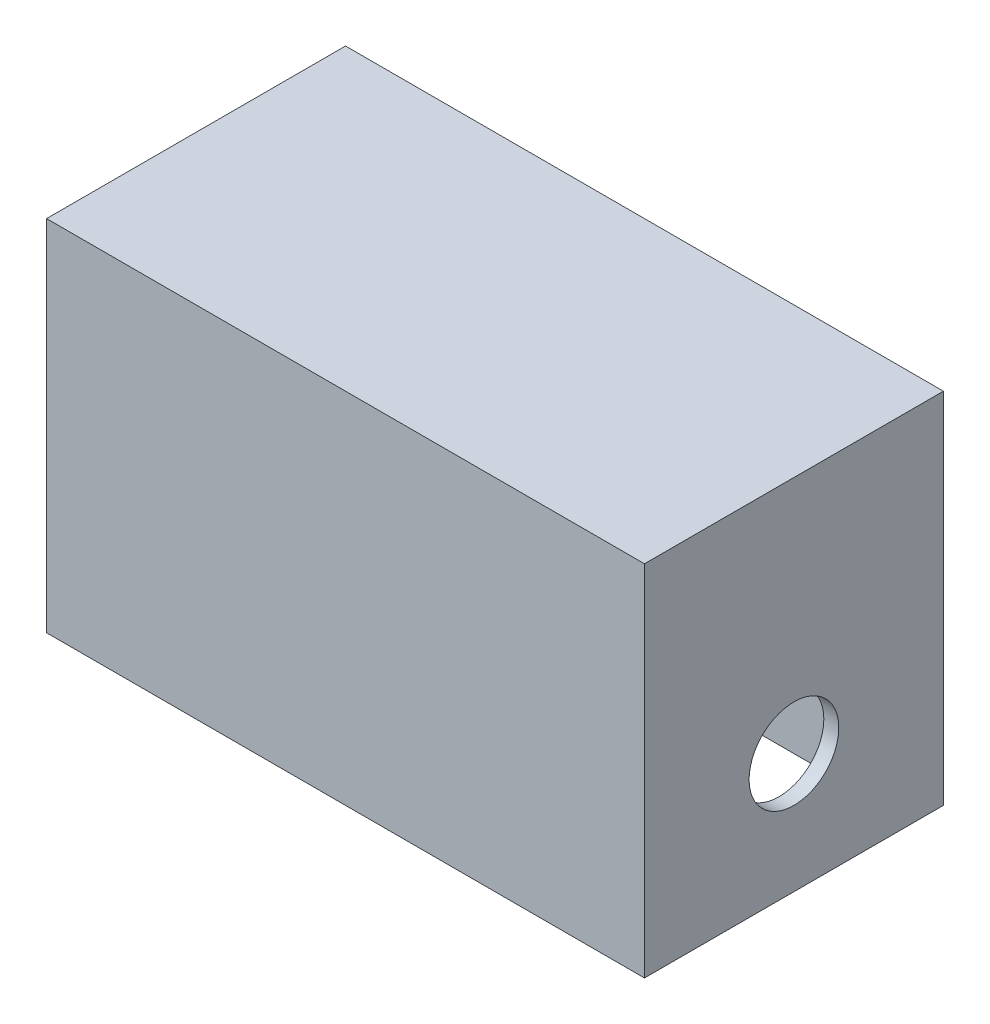
ISO-10303-21;
HEADER;
FILE_DESCRIPTION(('STEP AP214'),'2;1');
FILE_NAME('part.step','',(''),(''),'','','');
FILE_SCHEMA(('AUTOMOTIVE_DESIGN { 1 0 10303 214 1 1 1 1 }'));
ENDSEC;
DATA;
#1=APPLICATION_CONTEXT('core data for automotive mechanical design processes');
#2=APPLICATION_PROTOCOL_DEFINITION('international standard','automotive_design',2000,#1);
#3=PRODUCT_CONTEXT('',#1,'mechanical');
#4=PRODUCT('Part','Part','',(#3));
#5=PRODUCT_RELATED_PRODUCT_CATEGORY('part','',(#4));
#6=PRODUCT_DEFINITION_FORMATION('','',#4);
#7=PRODUCT_DEFINITION_CONTEXT('part definition',#1,'design');
#8=PRODUCT_DEFINITION('design','',#6,#7);
#9=PRODUCT_DEFINITION_SHAPE('','',#8);
#10=(LENGTH_UNIT() NAMED_UNIT(*) SI_UNIT(.MILLI.,.METRE.));
#11=(NAMED_UNIT(*) PLANE_ANGLE_UNIT() SI_UNIT($,.RADIAN.));
#12=(NAMED_UNIT(*) SI_UNIT($,.STERADIAN.) SOLID_ANGLE_UNIT());
#13=UNCERTAINTY_MEASURE_WITH_UNIT(LENGTH_MEASURE(1.E-05),#10,'distance_accuracy_value','');
#14=(GEOMETRIC_REPRESENTATION_CONTEXT(3) GLOBAL_UNCERTAINTY_ASSIGNED_CONTEXT((#13)) GLOBAL_UNIT_ASSIGNED_CONTEXT((#10,
#11,#12)) REPRESENTATION_CONTEXT('',''));
#15=CARTESIAN_POINT('',(0.,0.,0.));
#16=DIRECTION('',(0.,0.,1.));
#17=DIRECTION('',(1.,0.,0.));
#18=AXIS2_PLACEMENT_3D('',#15,#16,#17);
#19=CARTESIAN_POINT('',(0.,0.,50.));
#20=DIRECTION('',(1.,0.,0.));
#21=DIRECTION('',(0.,0.,-1.));
#22=AXIS2_PLACEMENT_3D('',#19,#20,#21);
#23=PLANE('',#22);
#24=CARTESIAN_POINT('',(0.,20.,25.));
#25=DIRECTION('',(-1.,0.,0.));
#26=DIRECTION('',(0.,0.,1.));
#27=AXIS2_PLACEMENT_3D('',#24,#25,#26);
#28=CIRCLE('',#27,7.5);
#29=CARTESIAN_POINT('',(0.,20.,32.5));
#30=VERTEX_POINT('',#29);
#31=EDGE_CURVE('E219',#30,#30,#28,.T.);
#32=ORIENTED_EDGE('',*,*,#31,.F.);
#33=EDGE_LOOP('',(#32));
#34=FACE_BOUND('',#33,.T.);
#35=DIRECTION('',(0.,-1.,0.));
#36=VECTOR('',#35,1.);
#37=CARTESIAN_POINT('',(0.,0.,0.));
#38=LINE('',#37,#36);
#39=CARTESIAN_POINT('',(0.,60.,0.));
#40=VERTEX_POINT('',#39);
#41=CARTESIAN_POINT('',(0.,0.,0.));
#42=VERTEX_POINT('',#41);
#43=EDGE_CURVE('E163',#40,#42,#38,.T.);
#44=ORIENTED_EDGE('',*,*,#43,.T.);
#45=DIRECTION('',(0.,0.,-1.));
#46=VECTOR('',#45,1.);
#47=CARTESIAN_POINT('',(0.,0.,50.));
#48=LINE('',#47,#46);
#49=CARTESIAN_POINT('',(0.,0.,50.));
#50=VERTEX_POINT('',#49);
#51=EDGE_CURVE('E13',#50,#42,#48,.T.);
#52=ORIENTED_EDGE('',*,*,#51,.F.);
#53=DIRECTION('',(0.,-1.,0.));
#54=VECTOR('',#53,1.);
#55=CARTESIAN_POINT('',(0.,0.,50.));
#56=LINE('',#55,#54);
#57=CARTESIAN_POINT('',(0.,60.,50.));
#58=VERTEX_POINT('',#57);
#59=EDGE_CURVE('E167',#58,#50,#56,.T.);
#60=ORIENTED_EDGE('',*,*,#59,.F.);
#61=DIRECTION('',(0.,0.,-1.));
#62=VECTOR('',#61,1.);
#63=CARTESIAN_POINT('',(0.,60.,50.));
#64=LINE('',#63,#62);
#65=EDGE_CURVE('E173',#58,#40,#64,.T.);
#66=ORIENTED_EDGE('',*,*,#65,.T.);
#67=EDGE_LOOP('',(#44,#52,#60,#66));
#68=FACE_BOUND('',#67,.T.);
#69=ADVANCED_FACE('F51',(#34,#68),#23,.F.);
#70=CARTESIAN_POINT('',(0.,0.,50.));
#71=DIRECTION('',(0.,1.,0.));
#72=DIRECTION('',(0.,0.,1.));
#73=AXIS2_PLACEMENT_3D('',#70,#71,#72);
#74=PLANE('',#73);
#75=DIRECTION('',(1.,0.,0.));
#76=VECTOR('',#75,1.);
#77=CARTESIAN_POINT('',(2.5,0.,5.));
#78=LINE('',#77,#76);
#79=CARTESIAN_POINT('',(2.5,0.,5.00000000000001));
#80=VERTEX_POINT('',#79);
#81=CARTESIAN_POINT('',(97.5,0.,5.00000000000002));
#82=VERTEX_POINT('',#81);
#83=EDGE_CURVE('E157',#80,#82,#78,.T.);
#84=ORIENTED_EDGE('',*,*,#83,.F.);
#85=DIRECTION('',(0.,0.,-1.));
#86=VECTOR('',#85,1.);
#87=CARTESIAN_POINT('',(2.49999999999999,0.,45.));
#88=LINE('',#87,#86);
#89=CARTESIAN_POINT('',(2.49999999999999,0.,45.));
#90=VERTEX_POINT('',#89);
#91=EDGE_CURVE('E66',#90,#80,#88,.T.);
#92=ORIENTED_EDGE('',*,*,#91,.F.);
#93=DIRECTION('',(-1.,0.,0.));
#94=VECTOR('',#93,1.);
#95=CARTESIAN_POINT('',(2.49999999999999,0.,45.));
#96=LINE('',#95,#94);
#97=CARTESIAN_POINT('',(97.5,0.,45.));
#98=VERTEX_POINT('',#97);
#99=EDGE_CURVE('E145',#98,#90,#96,.T.);
#100=ORIENTED_EDGE('',*,*,#99,.F.);
#101=DIRECTION('',(0.,0.,1.));
#102=VECTOR('',#101,1.);
#103=CARTESIAN_POINT('',(97.5,0.,45.));
#104=LINE('',#103,#102);
#105=EDGE_CURVE('E148',#82,#98,#104,.T.);
#106=ORIENTED_EDGE('',*,*,#105,.F.);
#107=EDGE_LOOP('',(#84,#92,#100,#106));
#108=FACE_BOUND('',#107,.T.);
#109=DIRECTION('',(1.,0.,0.));
#110=VECTOR('',#109,1.);
#111=CARTESIAN_POINT('',(0.,0.,0.));
#112=LINE('',#111,#110);
#113=CARTESIAN_POINT('',(100.,0.,0.));
#114=VERTEX_POINT('',#113);
#115=EDGE_CURVE('E176',#42,#114,#112,.T.);
#116=ORIENTED_EDGE('',*,*,#115,.T.);
#117=DIRECTION('',(0.,0.,-1.));
#118=VECTOR('',#117,1.);
#119=CARTESIAN_POINT('',(100.,0.,50.));
#120=LINE('',#119,#118);
#121=CARTESIAN_POINT('',(100.,0.,50.));
#122=VERTEX_POINT('',#121);
#123=EDGE_CURVE('E59',#122,#114,#120,.T.);
#124=ORIENTED_EDGE('',*,*,#123,.F.);
#125=DIRECTION('',(1.,0.,0.));
#126=VECTOR('',#125,1.);
#127=CARTESIAN_POINT('',(0.,0.,50.));
#128=LINE('',#127,#126);
#129=EDGE_CURVE('E103',#50,#122,#128,.T.);
#130=ORIENTED_EDGE('',*,*,#129,.F.);
#131=ORIENTED_EDGE('',*,*,#51,.T.);
#132=EDGE_LOOP('',(#116,#124,#130,#131));
#133=FACE_BOUND('',#132,.T.);
#134=ADVANCED_FACE('F206',(#108,#133),#74,.F.);
#135=CARTESIAN_POINT('',(100.,0.,50.));
#136=DIRECTION('',(-1.,0.,0.));
#137=DIRECTION('',(0.,0.,1.));
#138=AXIS2_PLACEMENT_3D('',#135,#136,#137);
#139=PLANE('',#138);
#140=CARTESIAN_POINT('',(100.,20.,25.));
#141=DIRECTION('',(-1.,0.,0.));
#142=DIRECTION('',(0.,0.,1.));
#143=AXIS2_PLACEMENT_3D('',#140,#141,#142);
#144=CIRCLE('',#143,7.5);
#145=CARTESIAN_POINT('',(100.,20.,32.5));
#146=VERTEX_POINT('',#145);
#147=EDGE_CURVE('E221',#146,#146,#144,.T.);
#148=ORIENTED_EDGE('',*,*,#147,.T.);
#149=EDGE_LOOP('',(#148));
#150=FACE_BOUND('',#149,.T.);
#151=DIRECTION('',(0.,1.,0.));
#152=VECTOR('',#151,1.);
#153=CARTESIAN_POINT('',(100.,0.,0.));
#154=LINE('',#153,#152);
#155=CARTESIAN_POINT('',(100.,60.,0.));
#156=VERTEX_POINT('',#155);
#157=EDGE_CURVE('E178',#114,#156,#154,.T.);
#158=ORIENTED_EDGE('',*,*,#157,.T.);
#159=DIRECTION('',(0.,0.,-1.));
#160=VECTOR('',#159,1.);
#161=CARTESIAN_POINT('',(100.,60.,50.));
#162=LINE('',#161,#160);
#163=CARTESIAN_POINT('',(100.,60.,50.));
#164=VERTEX_POINT('',#163);
#165=EDGE_CURVE('E182',#164,#156,#162,.T.);
#166=ORIENTED_EDGE('',*,*,#165,.F.);
#167=DIRECTION('',(0.,1.,0.));
#168=VECTOR('',#167,1.);
#169=CARTESIAN_POINT('',(100.,0.,50.));
#170=LINE('',#169,#168);
#171=EDGE_CURVE('E170',#122,#164,#170,.T.);
#172=ORIENTED_EDGE('',*,*,#171,.F.);
#173=ORIENTED_EDGE('',*,*,#123,.T.);
#174=EDGE_LOOP('',(#158,#166,#172,#173));
#175=FACE_BOUND('',#174,.T.);
#176=ADVANCED_FACE('F188',(#150,#175),#139,.F.);
#177=CARTESIAN_POINT('',(0.,60.,50.));
#178=DIRECTION('',(0.,-1.,0.));
#179=DIRECTION('',(0.,0.,-1.));
#180=AXIS2_PLACEMENT_3D('',#177,#178,#179);
#181=PLANE('',#180);
#182=DIRECTION('',(-1.,0.,0.));
#183=VECTOR('',#182,1.);
#184=CARTESIAN_POINT('',(0.,60.,0.));
#185=LINE('',#184,#183);
#186=EDGE_CURVE('E96',#156,#40,#185,.T.);
#187=ORIENTED_EDGE('',*,*,#186,.T.);
#188=ORIENTED_EDGE('',*,*,#65,.F.);
#189=DIRECTION('',(-1.,0.,0.));
#190=VECTOR('',#189,1.);
#191=CARTESIAN_POINT('',(0.,60.,50.));
#192=LINE('',#191,#190);
#193=EDGE_CURVE('E75',#164,#58,#192,.T.);
#194=ORIENTED_EDGE('',*,*,#193,.F.);
#195=ORIENTED_EDGE('',*,*,#165,.T.);
#196=EDGE_LOOP('',(#187,#188,#194,#195));
#197=FACE_BOUND('',#196,.T.);
#198=ADVANCED_FACE('F196',(#197),#181,.F.);
#199=CARTESIAN_POINT('',(0.,0.,50.));
#200=DIRECTION('',(0.,0.,-1.));
#201=DIRECTION('',(-1.,0.,0.));
#202=AXIS2_PLACEMENT_3D('',#199,#200,#201);
#203=PLANE('',#202);
#204=ORIENTED_EDGE('',*,*,#59,.T.);
#205=ORIENTED_EDGE('',*,*,#129,.T.);
#206=ORIENTED_EDGE('',*,*,#171,.T.);
#207=ORIENTED_EDGE('',*,*,#193,.T.);
#208=EDGE_LOOP('',(#204,#205,#206,#207));
#209=FACE_BOUND('',#208,.T.);
#210=ADVANCED_FACE('F198',(#209),#203,.F.);
#211=CARTESIAN_POINT('',(0.,0.,0.));
#212=DIRECTION('',(0.,0.,-1.));
#213=DIRECTION('',(-1.,0.,0.));
#214=AXIS2_PLACEMENT_3D('',#211,#212,#213);
#215=PLANE('',#214);
#216=ORIENTED_EDGE('',*,*,#43,.F.);
#217=ORIENTED_EDGE('',*,*,#186,.F.);
#218=ORIENTED_EDGE('',*,*,#157,.F.);
#219=ORIENTED_EDGE('',*,*,#115,.F.);
#220=EDGE_LOOP('',(#216,#217,#218,#219));
#221=FACE_BOUND('',#220,.T.);
#222=ADVANCED_FACE('F192',(#221),#215,.T.);
#223=CARTESIAN_POINT('',(2.49999999999999,55.,45.));
#224=DIRECTION('',(-1.,0.,0.));
#225=DIRECTION('',(0.,0.,1.));
#226=AXIS2_PLACEMENT_3D('',#223,#224,#225);
#227=PLANE('',#226);
#228=CARTESIAN_POINT('',(2.49999999999999,20.,25.));
#229=DIRECTION('',(-1.,0.,0.));
#230=DIRECTION('',(0.,0.,1.));
#231=AXIS2_PLACEMENT_3D('',#228,#229,#230);
#232=CIRCLE('',#231,7.5);
#233=CARTESIAN_POINT('',(2.49999999999999,20.,32.5));
#234=VERTEX_POINT('',#233);
#235=EDGE_CURVE('E151',#234,#234,#232,.T.);
#236=ORIENTED_EDGE('',*,*,#235,.T.);
#237=EDGE_LOOP('',(#236));
#238=FACE_BOUND('',#237,.T.);
#239=ORIENTED_EDGE('',*,*,#91,.T.);
#240=DIRECTION('',(0.,-1.,0.));
#241=VECTOR('',#240,1.);
#242=CARTESIAN_POINT('',(2.5,55.,5.));
#243=LINE('',#242,#241);
#244=CARTESIAN_POINT('',(2.5,55.,5.));
#245=VERTEX_POINT('',#244);
#246=EDGE_CURVE('E123',#245,#80,#243,.T.);
#247=ORIENTED_EDGE('',*,*,#246,.F.);
#248=DIRECTION('',(0.,0.,-1.));
#249=VECTOR('',#248,1.);
#250=CARTESIAN_POINT('',(2.49999999999999,55.,45.));
#251=LINE('',#250,#249);
#252=CARTESIAN_POINT('',(2.49999999999999,55.,45.));
#253=VERTEX_POINT('',#252);
#254=EDGE_CURVE('E127',#253,#245,#251,.T.);
#255=ORIENTED_EDGE('',*,*,#254,.F.);
#256=DIRECTION('',(0.,-1.,0.));
#257=VECTOR('',#256,1.);
#258=CARTESIAN_POINT('',(2.49999999999999,55.,45.));
#259=LINE('',#258,#257);
#260=EDGE_CURVE('E161',#253,#90,#259,.T.);
#261=ORIENTED_EDGE('',*,*,#260,.T.);
#262=EDGE_LOOP('',(#239,#247,#255,#261));
#263=FACE_BOUND('',#262,.T.);
#264=ADVANCED_FACE('F125',(#238,#263),#227,.F.);
#265=CARTESIAN_POINT('',(2.49999999999999,55.,45.));
#266=DIRECTION('',(0.,0.,1.));
#267=DIRECTION('',(1.,0.,0.));
#268=AXIS2_PLACEMENT_3D('',#265,#266,#267);
#269=PLANE('',#268);
#270=ORIENTED_EDGE('',*,*,#99,.T.);
#271=ORIENTED_EDGE('',*,*,#260,.F.);
#272=DIRECTION('',(-1.,0.,0.));
#273=VECTOR('',#272,1.);
#274=CARTESIAN_POINT('',(2.49999999999999,55.,45.));
#275=LINE('',#274,#273);
#276=CARTESIAN_POINT('',(97.5,55.,45.));
#277=VERTEX_POINT('',#276);
#278=EDGE_CURVE('E133',#277,#253,#275,.T.);
#279=ORIENTED_EDGE('',*,*,#278,.F.);
#280=DIRECTION('',(0.,-1.,0.));
#281=VECTOR('',#280,1.);
#282=CARTESIAN_POINT('',(97.5,55.,45.));
#283=LINE('',#282,#281);
#284=EDGE_CURVE('E164',#277,#98,#283,.T.);
#285=ORIENTED_EDGE('',*,*,#284,.T.);
#286=EDGE_LOOP('',(#270,#271,#279,#285));
#287=FACE_BOUND('',#286,.T.);
#288=ADVANCED_FACE('F243',(#287),#269,.F.);
#289=CARTESIAN_POINT('',(97.5,55.,45.));
#290=DIRECTION('',(1.,0.,0.));
#291=DIRECTION('',(0.,0.,-1.));
#292=AXIS2_PLACEMENT_3D('',#289,#290,#291);
#293=PLANE('',#292);
#294=CARTESIAN_POINT('',(97.5,20.,25.));
#295=DIRECTION('',(1.,0.,0.));
#296=DIRECTION('',(0.,0.,-1.));
#297=AXIS2_PLACEMENT_3D('',#294,#295,#296);
#298=CIRCLE('',#297,7.5);
#299=CARTESIAN_POINT('',(97.5,20.,17.5));
#300=VERTEX_POINT('',#299);
#301=EDGE_CURVE('E54',#300,#300,#298,.T.);
#302=ORIENTED_EDGE('',*,*,#301,.T.);
#303=EDGE_LOOP('',(#302));
#304=FACE_BOUND('',#303,.T.);
#305=ORIENTED_EDGE('',*,*,#105,.T.);
#306=ORIENTED_EDGE('',*,*,#284,.F.);
#307=DIRECTION('',(0.,0.,1.));
#308=VECTOR('',#307,1.);
#309=CARTESIAN_POINT('',(97.5,55.,45.));
#310=LINE('',#309,#308);
#311=CARTESIAN_POINT('',(97.5,55.,5.00000000000002));
#312=VERTEX_POINT('',#311);
#313=EDGE_CURVE('E141',#312,#277,#310,.T.);
#314=ORIENTED_EDGE('',*,*,#313,.F.);
#315=DIRECTION('',(0.,-1.,0.));
#316=VECTOR('',#315,1.);
#317=CARTESIAN_POINT('',(97.5,55.,5.00000000000002));
#318=LINE('',#317,#316);
#319=EDGE_CURVE('E132',#312,#82,#318,.T.);
#320=ORIENTED_EDGE('',*,*,#319,.T.);
#321=EDGE_LOOP('',(#305,#306,#314,#320));
#322=FACE_BOUND('',#321,.T.);
#323=ADVANCED_FACE('F246',(#304,#322),#293,.F.);
#324=CARTESIAN_POINT('',(2.5,55.,5.));
#325=DIRECTION('',(0.,0.,-1.));
#326=DIRECTION('',(-1.,0.,0.));
#327=AXIS2_PLACEMENT_3D('',#324,#325,#326);
#328=PLANE('',#327);
#329=ORIENTED_EDGE('',*,*,#83,.T.);
#330=ORIENTED_EDGE('',*,*,#319,.F.);
#331=DIRECTION('',(1.,0.,0.));
#332=VECTOR('',#331,1.);
#333=CARTESIAN_POINT('',(2.5,55.,5.));
#334=LINE('',#333,#332);
#335=EDGE_CURVE('E136',#245,#312,#334,.T.);
#336=ORIENTED_EDGE('',*,*,#335,.F.);
#337=ORIENTED_EDGE('',*,*,#246,.T.);
#338=EDGE_LOOP('',(#329,#330,#336,#337));
#339=FACE_BOUND('',#338,.T.);
#340=ADVANCED_FACE('F137',(#339),#328,.F.);
#341=CARTESIAN_POINT('',(0.,55.,0.));
#342=DIRECTION('',(0.,-1.,0.));
#343=DIRECTION('',(0.,0.,-1.));
#344=AXIS2_PLACEMENT_3D('',#341,#342,#343);
#345=PLANE('',#344);
#346=ORIENTED_EDGE('',*,*,#254,.T.);
#347=ORIENTED_EDGE('',*,*,#335,.T.);
#348=ORIENTED_EDGE('',*,*,#313,.T.);
#349=ORIENTED_EDGE('',*,*,#278,.T.);
#350=EDGE_LOOP('',(#346,#347,#348,#349));
#351=FACE_BOUND('',#350,.T.);
#352=ADVANCED_FACE('F143',(#351),#345,.T.);
#353=CARTESIAN_POINT('',(100.,20.,25.));
#354=DIRECTION('',(-1.,0.,0.));
#355=DIRECTION('',(0.,0.,1.));
#356=AXIS2_PLACEMENT_3D('',#353,#354,#355);
#357=CYLINDRICAL_SURFACE('',#356,7.5);
#358=ORIENTED_EDGE('',*,*,#147,.F.);
#359=EDGE_LOOP('',(#358));
#360=FACE_BOUND('',#359,.T.);
#361=ORIENTED_EDGE('',*,*,#301,.F.);
#362=EDGE_LOOP('',(#361));
#363=FACE_BOUND('',#362,.T.);
#364=ADVANCED_FACE('F234',(#360,#363),#357,.F.);
#365=ORIENTED_EDGE('',*,*,#31,.T.);
#366=EDGE_LOOP('',(#365));
#367=FACE_BOUND('',#366,.T.);
#368=ORIENTED_EDGE('',*,*,#235,.F.);
#369=EDGE_LOOP('',(#368));
#370=FACE_BOUND('',#369,.T.);
#371=ADVANCED_FACE('F232',(#367,#370),#357,.F.);
#372=CLOSED_SHELL('',(#69,#134,#176,#198,#210,#222,#264,#288,#323,#340,#352,#364,#371));
#373=MANIFOLD_SOLID_BREP('B2',#372);
#374=ADVANCED_BREP_SHAPE_REPRESENTATION('',(#18,#373),#14);
#375=SHAPE_DEFINITION_REPRESENTATION(#9,#374);
ENDSEC;
END-ISO-10303-21;
